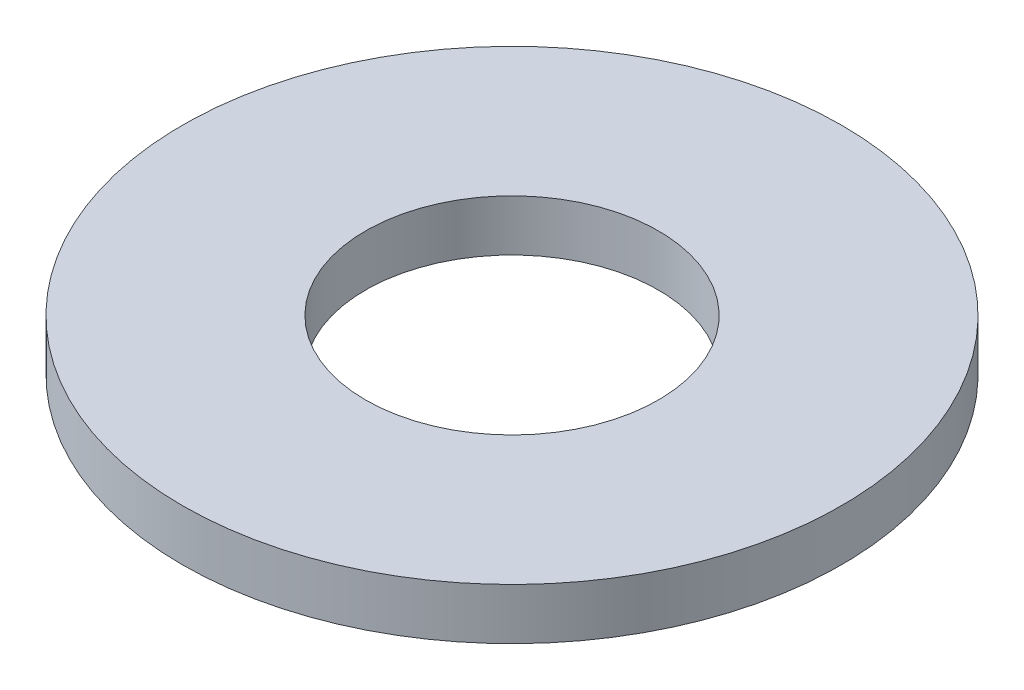
ISO-10303-21;
HEADER;
FILE_DESCRIPTION(('STEP AP214'),'2;1');
FILE_NAME('part.step','',(''),(''),'','','');
FILE_SCHEMA(('AUTOMOTIVE_DESIGN { 1 0 10303 214 1 1 1 1 }'));
ENDSEC;
DATA;
#1=APPLICATION_CONTEXT('core data for automotive mechanical design processes');
#2=APPLICATION_PROTOCOL_DEFINITION('international standard','automotive_design',2000,#1);
#3=PRODUCT_CONTEXT('',#1,'mechanical');
#4=PRODUCT('Part','Part','',(#3));
#5=PRODUCT_RELATED_PRODUCT_CATEGORY('part','',(#4));
#6=PRODUCT_DEFINITION_FORMATION('','',#4);
#7=PRODUCT_DEFINITION_CONTEXT('part definition',#1,'design');
#8=PRODUCT_DEFINITION('design','',#6,#7);
#9=PRODUCT_DEFINITION_SHAPE('','',#8);
#10=(LENGTH_UNIT() NAMED_UNIT(*) SI_UNIT(.MILLI.,.METRE.));
#11=(NAMED_UNIT(*) PLANE_ANGLE_UNIT() SI_UNIT($,.RADIAN.));
#12=(NAMED_UNIT(*) SI_UNIT($,.STERADIAN.) SOLID_ANGLE_UNIT());
#13=UNCERTAINTY_MEASURE_WITH_UNIT(LENGTH_MEASURE(1.E-05),#10,'distance_accuracy_value','');
#14=(GEOMETRIC_REPRESENTATION_CONTEXT(3) GLOBAL_UNCERTAINTY_ASSIGNED_CONTEXT((#13)) GLOBAL_UNIT_ASSIGNED_CONTEXT((#10,
#11,#12)) REPRESENTATION_CONTEXT('',''));
#15=CARTESIAN_POINT('',(0.,0.,0.));
#16=DIRECTION('',(0.,0.,1.));
#17=DIRECTION('',(1.,0.,0.));
#18=AXIS2_PLACEMENT_3D('',#15,#16,#17);
#19=CARTESIAN_POINT('',(0.,14.,0.));
#20=DIRECTION('',(0.,-1.,0.));
#21=DIRECTION('',(0.,0.,-1.));
#22=AXIS2_PLACEMENT_3D('',#19,#20,#21);
#23=CYLINDRICAL_SURFACE('',#22,90.);
#24=CARTESIAN_POINT('',(0.,14.,0.));
#25=DIRECTION('',(0.,1.,0.));
#26=DIRECTION('',(0.,0.,1.));
#27=AXIS2_PLACEMENT_3D('',#24,#25,#26);
#28=CIRCLE('',#27,90.);
#29=CARTESIAN_POINT('',(0.,14.,90.));
#30=VERTEX_POINT('',#29);
#31=EDGE_CURVE('E10',#30,#30,#28,.T.);
#32=ORIENTED_EDGE('',*,*,#31,.F.);
#33=EDGE_LOOP('',(#32));
#34=FACE_BOUND('',#33,.T.);
#35=CARTESIAN_POINT('',(0.,0.,0.));
#36=DIRECTION('',(0.,1.,0.));
#37=DIRECTION('',(0.,0.,1.));
#38=AXIS2_PLACEMENT_3D('',#35,#36,#37);
#39=CIRCLE('',#38,90.);
#40=CARTESIAN_POINT('',(0.,0.,90.));
#41=VERTEX_POINT('',#40);
#42=EDGE_CURVE('E37',#41,#41,#39,.T.);
#43=ORIENTED_EDGE('',*,*,#42,.T.);
#44=EDGE_LOOP('',(#43));
#45=FACE_BOUND('',#44,.T.);
#46=ADVANCED_FACE('F40',(#34,#45),#23,.T.);
#47=CARTESIAN_POINT('',(0.,14.,0.));
#48=DIRECTION('',(0.,1.,0.));
#49=DIRECTION('',(0.,0.,1.));
#50=AXIS2_PLACEMENT_3D('',#47,#48,#49);
#51=PLANE('',#50);
#52=CARTESIAN_POINT('',(0.,14.,0.));
#53=DIRECTION('',(0.,1.,0.));
#54=DIRECTION('',(0.,0.,1.));
#55=AXIS2_PLACEMENT_3D('',#52,#53,#54);
#56=CIRCLE('',#55,40.);
#57=CARTESIAN_POINT('',(0.,14.,40.));
#58=VERTEX_POINT('',#57);
#59=EDGE_CURVE('E50',#58,#58,#56,.T.);
#60=ORIENTED_EDGE('',*,*,#59,.F.);
#61=EDGE_LOOP('',(#60));
#62=FACE_BOUND('',#61,.T.);
#63=ORIENTED_EDGE('',*,*,#31,.T.);
#64=EDGE_LOOP('',(#63));
#65=FACE_BOUND('',#64,.T.);
#66=ADVANCED_FACE('F59',(#62,#65),#51,.T.);
#67=CARTESIAN_POINT('',(0.,0.,0.));
#68=DIRECTION('',(0.,1.,0.));
#69=DIRECTION('',(0.,0.,1.));
#70=AXIS2_PLACEMENT_3D('',#67,#68,#69);
#71=PLANE('',#70);
#72=CARTESIAN_POINT('',(0.,0.,0.));
#73=DIRECTION('',(0.,1.,0.));
#74=DIRECTION('',(0.,0.,1.));
#75=AXIS2_PLACEMENT_3D('',#72,#73,#74);
#76=CIRCLE('',#75,40.);
#77=CARTESIAN_POINT('',(0.,0.,40.));
#78=VERTEX_POINT('',#77);
#79=EDGE_CURVE('E47',#78,#78,#76,.T.);
#80=ORIENTED_EDGE('',*,*,#79,.T.);
#81=EDGE_LOOP('',(#80));
#82=FACE_BOUND('',#81,.T.);
#83=ORIENTED_EDGE('',*,*,#42,.F.);
#84=EDGE_LOOP('',(#83));
#85=FACE_BOUND('',#84,.T.);
#86=ADVANCED_FACE('F58',(#82,#85),#71,.F.);
#87=CARTESIAN_POINT('',(0.,14.,0.));
#88=DIRECTION('',(0.,-1.,0.));
#89=DIRECTION('',(0.,0.,-1.));
#90=AXIS2_PLACEMENT_3D('',#87,#88,#89);
#91=CYLINDRICAL_SURFACE('',#90,40.);
#92=ORIENTED_EDGE('',*,*,#59,.T.);
#93=EDGE_LOOP('',(#92));
#94=FACE_BOUND('',#93,.T.);
#95=ORIENTED_EDGE('',*,*,#79,.F.);
#96=EDGE_LOOP('',(#95));
#97=FACE_BOUND('',#96,.T.);
#98=ADVANCED_FACE('F54',(#94,#97),#91,.F.);
#99=CLOSED_SHELL('',(#46,#66,#86,#98));
#100=MANIFOLD_SOLID_BREP('B2',#99);
#101=ADVANCED_BREP_SHAPE_REPRESENTATION('',(#18,#100),#14);
#102=SHAPE_DEFINITION_REPRESENTATION(#9,#101);
ENDSEC;
END-ISO-10303-21;
